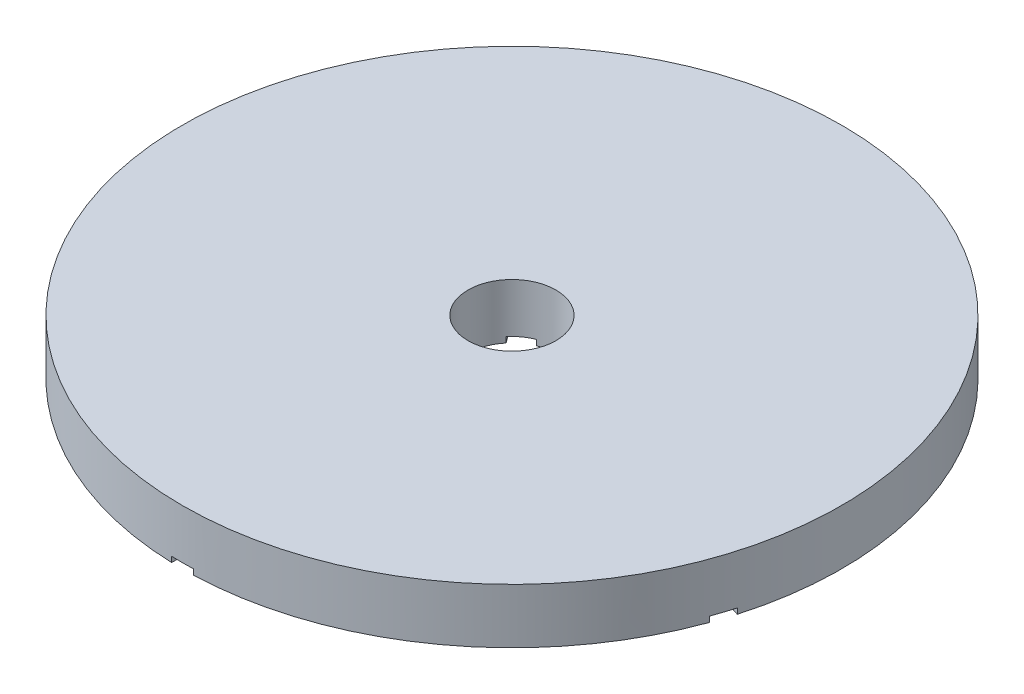
ISO-10303-21;
HEADER;
FILE_DESCRIPTION(('STEP AP214'),'2;1');
FILE_NAME('part.step','',(''),(''),'','','');
FILE_SCHEMA(('AUTOMOTIVE_DESIGN { 1 0 10303 214 1 1 1 1 }'));
ENDSEC;
DATA;
#1=APPLICATION_CONTEXT('core data for automotive mechanical design processes');
#2=APPLICATION_PROTOCOL_DEFINITION('international standard','automotive_design',2000,#1);
#3=PRODUCT_CONTEXT('',#1,'mechanical');
#4=PRODUCT('Part','Part','',(#3));
#5=PRODUCT_RELATED_PRODUCT_CATEGORY('part','',(#4));
#6=PRODUCT_DEFINITION_FORMATION('','',#4);
#7=PRODUCT_DEFINITION_CONTEXT('part definition',#1,'design');
#8=PRODUCT_DEFINITION('design','',#6,#7);
#9=PRODUCT_DEFINITION_SHAPE('','',#8);
#10=(LENGTH_UNIT() NAMED_UNIT(*) SI_UNIT(.MILLI.,.METRE.));
#11=(NAMED_UNIT(*) PLANE_ANGLE_UNIT() SI_UNIT($,.RADIAN.));
#12=(NAMED_UNIT(*) SI_UNIT($,.STERADIAN.) SOLID_ANGLE_UNIT());
#13=UNCERTAINTY_MEASURE_WITH_UNIT(LENGTH_MEASURE(1.E-05),#10,'distance_accuracy_value','');
#14=(GEOMETRIC_REPRESENTATION_CONTEXT(3) GLOBAL_UNCERTAINTY_ASSIGNED_CONTEXT((#13)) GLOBAL_UNIT_ASSIGNED_CONTEXT((#10,
#11,#12)) REPRESENTATION_CONTEXT('',''));
#15=CARTESIAN_POINT('',(0.,0.,0.));
#16=DIRECTION('',(0.,0.,1.));
#17=DIRECTION('',(1.,0.,0.));
#18=AXIS2_PLACEMENT_3D('',#15,#16,#17);
#19=CARTESIAN_POINT('',(0.,0.25,0.));
#20=DIRECTION('',(0.,1.,0.));
#21=DIRECTION('',(0.,0.,1.));
#22=AXIS2_PLACEMENT_3D('',#19,#20,#21);
#23=PLANE('',#22);
#24=CARTESIAN_POINT('',(0.,0.25,0.));
#25=DIRECTION('',(0.,1.,0.));
#26=DIRECTION('',(0.,0.,1.));
#27=AXIS2_PLACEMENT_3D('',#24,#25,#26);
#28=CIRCLE('',#27,2.);
#29=CARTESIAN_POINT('',(-1.68720452726912,0.25,1.07393709460219));
#30=VERTEX_POINT('',#29);
#31=CARTESIAN_POINT('',(-1.99622152164406,0.25,0.122880578307047));
#32=VERTEX_POINT('',#31);
#33=EDGE_CURVE('E421',#30,#32,#28,.F.);
#34=ORIENTED_EDGE('',*,*,#33,.F.);
#35=DIRECTION('',(-0.951056516295154,0.,0.309016994374945));
#36=VECTOR('',#35,1.);
#37=CARTESIAN_POINT('',(0.154508497187472,0.25,0.475528258147574));
#38=LINE('',#37,#36);
#39=CARTESIAN_POINT('',(-14.1034115735271,0.25,5.10820731643717));
#40=VERTEX_POINT('',#39);
#41=EDGE_CURVE('E339',#30,#40,#38,.T.);
#42=ORIENTED_EDGE('',*,*,#41,.T.);
#43=CARTESIAN_POINT('',(0.,0.25,0.));
#44=DIRECTION('',(0.,1.,0.));
#45=DIRECTION('',(0.,0.,1.));
#46=AXIS2_PLACEMENT_3D('',#43,#44,#45);
#47=CIRCLE('',#46,15.);
#48=CARTESIAN_POINT('',(-14.412428567902,0.25,4.15715080014206));
#49=VERTEX_POINT('',#48);
#50=EDGE_CURVE('E322',#49,#40,#47,.T.);
#51=ORIENTED_EDGE('',*,*,#50,.F.);
#52=DIRECTION('',(0.951056516295154,0.,-0.309016994374948));
#53=VECTOR('',#52,1.);
#54=CARTESIAN_POINT('',(-0.154508497187473,0.25,-0.475528258147574));
#55=LINE('',#54,#53);
#56=EDGE_CURVE('E337',#49,#32,#55,.T.);
#57=ORIENTED_EDGE('',*,*,#56,.T.);
#58=EDGE_LOOP('',(#34,#42,#51,#57));
#59=FACE_BOUND('',#58,.T.);
#60=ADVANCED_FACE('F93',(#59),#23,.F.);
#61=CARTESIAN_POINT('',(-1.542749743825,0.25,-1.27276204686025));
#62=VERTEX_POINT('',#61);
#63=CARTESIAN_POINT('',(-0.733732749450056,0.25,-1.86054729915272));
#64=VERTEX_POINT('',#63);
#65=EDGE_CURVE('E418',#62,#64,#28,.F.);
#66=ORIENTED_EDGE('',*,*,#65,.F.);
#67=DIRECTION('',(-0.587785252292469,0.,-0.809016994374951));
#68=VECTOR('',#67,1.);
#69=CARTESIAN_POINT('',(-0.404508497187473,0.25,0.293892626146233));
#70=LINE('',#69,#68);
#71=CARTESIAN_POINT('',(-9.2163877097683,0.25,-11.8346186074259));
#72=VERTEX_POINT('',#71);
#73=EDGE_CURVE('E345',#62,#72,#70,.T.);
#74=ORIENTED_EDGE('',*,*,#73,.T.);
#75=CARTESIAN_POINT('',(-8.40737071539336,0.25,-12.4224038597184));
#76=VERTEX_POINT('',#75);
#77=EDGE_CURVE('E324',#76,#72,#47,.T.);
#78=ORIENTED_EDGE('',*,*,#77,.F.);
#79=DIRECTION('',(0.587785252292469,0.,0.809016994374951));
#80=VECTOR('',#79,1.);
#81=CARTESIAN_POINT('',(0.404508497187473,0.25,-0.293892626146233));
#82=LINE('',#81,#80);
#83=EDGE_CURVE('E349',#76,#64,#82,.T.);
#84=ORIENTED_EDGE('',*,*,#83,.T.);
#85=EDGE_LOOP('',(#66,#74,#78,#84));
#86=FACE_BOUND('',#85,.T.);
#87=ADVANCED_FACE('F442',(#86),#23,.F.);
#88=CARTESIAN_POINT('',(0.733732749450082,0.25,-1.8605472991527));
#89=VERTEX_POINT('',#88);
#90=CARTESIAN_POINT('',(1.54274974382502,0.25,-1.27276204686023));
#91=VERTEX_POINT('',#90);
#92=EDGE_CURVE('E408',#89,#91,#28,.F.);
#93=ORIENTED_EDGE('',*,*,#92,.F.);
#94=DIRECTION('',(0.58778525229248,0.,-0.809016994374942));
#95=VECTOR('',#94,1.);
#96=CARTESIAN_POINT('',(-0.404508497187469,0.25,-0.293892626146238));
#97=LINE('',#96,#95);
#98=CARTESIAN_POINT('',(8.40737071539353,0.25,-12.4224038597183));
#99=VERTEX_POINT('',#98);
#100=EDGE_CURVE('E115',#89,#99,#97,.T.);
#101=ORIENTED_EDGE('',*,*,#100,.T.);
#102=CARTESIAN_POINT('',(9.21638770976847,0.25,-11.8346186074258));
#103=VERTEX_POINT('',#102);
#104=EDGE_CURVE('E101',#103,#99,#47,.T.);
#105=ORIENTED_EDGE('',*,*,#104,.F.);
#106=DIRECTION('',(-0.58778525229248,0.,0.809016994374942));
#107=VECTOR('',#106,1.);
#108=CARTESIAN_POINT('',(0.404508497187467,0.25,0.293892626146237));
#109=LINE('',#108,#107);
#110=EDGE_CURVE('E255',#103,#91,#109,.T.);
#111=ORIENTED_EDGE('',*,*,#110,.T.);
#112=EDGE_LOOP('',(#93,#101,#105,#111));
#113=FACE_BOUND('',#112,.T.);
#114=ADVANCED_FACE('F407',(#113),#23,.F.);
#115=CARTESIAN_POINT('',(1.99622152164406,0.25,0.12288057830707));
#116=VERTEX_POINT('',#115);
#117=CARTESIAN_POINT('',(1.6872045272691,0.25,1.07393709460221));
#118=VERTEX_POINT('',#117);
#119=EDGE_CURVE('E390',#116,#118,#28,.F.);
#120=ORIENTED_EDGE('',*,*,#119,.F.);
#121=DIRECTION('',(0.95105651629515,0.,0.309016994374958));
#122=VECTOR('',#121,1.);
#123=CARTESIAN_POINT('',(0.154508497187478,0.25,-0.475528258147572));
#124=LINE('',#123,#122);
#125=CARTESIAN_POINT('',(14.412428567902,0.25,4.15715080014222));
#126=VERTEX_POINT('',#125);
#127=EDGE_CURVE('E264',#116,#126,#124,.T.);
#128=ORIENTED_EDGE('',*,*,#127,.T.);
#129=CARTESIAN_POINT('',(14.103411573527,0.25,5.10820731643736));
#130=VERTEX_POINT('',#129);
#131=EDGE_CURVE('E317',#130,#126,#47,.T.);
#132=ORIENTED_EDGE('',*,*,#131,.F.);
#133=DIRECTION('',(-0.95105651629515,0.,-0.309016994374958));
#134=VECTOR('',#133,1.);
#135=CARTESIAN_POINT('',(14.1113392472398,0.25,5.11078317377194));
#136=LINE('',#135,#134);
#137=EDGE_CURVE('E266',#130,#118,#136,.T.);
#138=ORIENTED_EDGE('',*,*,#137,.T.);
#139=EDGE_LOOP('',(#120,#128,#132,#138));
#140=FACE_BOUND('',#139,.T.);
#141=ADVANCED_FACE('F389',(#140),#23,.F.);
#142=CARTESIAN_POINT('',(-0.404508497187469,0.25,-0.293892626146238));
#143=DIRECTION('',(-0.809016994374942,0.,-0.58778525229248));
#144=DIRECTION('',(-0.58778525229248,0.,0.809016994374942));
#145=AXIS2_PLACEMENT_3D('',#142,#143,#144);
#146=PLANE('',#145);
#147=DIRECTION('',(0.,-1.,0.));
#148=VECTOR('',#147,1.);
#149=CARTESIAN_POINT('',(0.733732749450082,2.5,-1.8605472991527));
#150=LINE('',#149,#148);
#151=CARTESIAN_POINT('',(0.733732749450082,0.,-1.8605472991527));
#152=VERTEX_POINT('',#151);
#153=EDGE_CURVE('E249',#152,#89,#150,.F.);
#154=ORIENTED_EDGE('',*,*,#153,.F.);
#155=DIRECTION('',(0.58778525229248,0.,-0.809016994374942));
#156=VECTOR('',#155,1.);
#157=CARTESIAN_POINT('',(-0.404508497187469,0.,-0.293892626146238));
#158=LINE('',#157,#156);
#159=CARTESIAN_POINT('',(8.40737071539353,0.,-12.4224038597183));
#160=VERTEX_POINT('',#159);
#161=EDGE_CURVE('E270',#152,#160,#158,.T.);
#162=ORIENTED_EDGE('',*,*,#161,.T.);
#163=DIRECTION('',(0.,-1.,0.));
#164=VECTOR('',#163,1.);
#165=CARTESIAN_POINT('',(8.40737071539353,2.5,-12.4224038597183));
#166=LINE('',#165,#164);
#167=EDGE_CURVE('E299',#99,#160,#166,.T.);
#168=ORIENTED_EDGE('',*,*,#167,.F.);
#169=ORIENTED_EDGE('',*,*,#100,.F.);
#170=EDGE_LOOP('',(#154,#162,#168,#169));
#171=FACE_BOUND('',#170,.T.);
#172=ADVANCED_FACE('F412',(#171),#146,.F.);
#173=CARTESIAN_POINT('',(0.404508497187473,0.25,-0.293892626146233));
#174=DIRECTION('',(0.809016994374951,0.,-0.587785252292469));
#175=DIRECTION('',(-0.587785252292469,0.,-0.809016994374951));
#176=AXIS2_PLACEMENT_3D('',#173,#174,#175);
#177=PLANE('',#176);
#178=DIRECTION('',(0.,-1.,0.));
#179=VECTOR('',#178,1.);
#180=CARTESIAN_POINT('',(-0.733732749450056,2.5,-1.86054729915271));
#181=LINE('',#180,#179);
#182=CARTESIAN_POINT('',(-0.733732749450055,0.,-1.86054729915272));
#183=VERTEX_POINT('',#182);
#184=EDGE_CURVE('E272',#64,#183,#181,.T.);
#185=ORIENTED_EDGE('',*,*,#184,.F.);
#186=ORIENTED_EDGE('',*,*,#83,.F.);
#187=DIRECTION('',(0.,-1.,0.));
#188=VECTOR('',#187,1.);
#189=CARTESIAN_POINT('',(-8.40737071539335,2.5,-12.4224038597184));
#190=LINE('',#189,#188);
#191=CARTESIAN_POINT('',(-8.40737071539336,0.,-12.4224038597184));
#192=VERTEX_POINT('',#191);
#193=EDGE_CURVE('E296',#192,#76,#190,.F.);
#194=ORIENTED_EDGE('',*,*,#193,.F.);
#195=DIRECTION('',(-0.587785252292469,0.,-0.809016994374951));
#196=VECTOR('',#195,1.);
#197=CARTESIAN_POINT('',(0.404508497187473,0.,-0.293892626146233));
#198=LINE('',#197,#196);
#199=EDGE_CURVE('E316',#183,#192,#198,.T.);
#200=ORIENTED_EDGE('',*,*,#199,.F.);
#201=EDGE_LOOP('',(#185,#186,#194,#200));
#202=FACE_BOUND('',#201,.T.);
#203=ADVANCED_FACE('F461',(#202),#177,.F.);
#204=CARTESIAN_POINT('',(-0.404508497187473,0.25,0.293892626146233));
#205=DIRECTION('',(-0.809016994374951,0.,0.587785252292469));
#206=DIRECTION('',(0.587785252292469,0.,0.809016994374951));
#207=AXIS2_PLACEMENT_3D('',#204,#205,#206);
#208=PLANE('',#207);
#209=DIRECTION('',(0.,-1.,0.));
#210=VECTOR('',#209,1.);
#211=CARTESIAN_POINT('',(-1.542749743825,2.5,-1.27276204686025));
#212=LINE('',#211,#210);
#213=CARTESIAN_POINT('',(-1.542749743825,0.,-1.27276204686025));
#214=VERTEX_POINT('',#213);
#215=EDGE_CURVE('E362',#214,#62,#212,.F.);
#216=ORIENTED_EDGE('',*,*,#215,.F.);
#217=DIRECTION('',(-0.587785252292469,0.,-0.809016994374951));
#218=VECTOR('',#217,1.);
#219=CARTESIAN_POINT('',(-0.404508497187473,0.,0.293892626146233));
#220=LINE('',#219,#218);
#221=CARTESIAN_POINT('',(-9.2163877097683,0.,-11.8346186074259));
#222=VERTEX_POINT('',#221);
#223=EDGE_CURVE('E260',#214,#222,#220,.T.);
#224=ORIENTED_EDGE('',*,*,#223,.T.);
#225=DIRECTION('',(0.,-1.,0.));
#226=VECTOR('',#225,1.);
#227=CARTESIAN_POINT('',(-9.2163877097683,2.5,-11.8346186074259));
#228=LINE('',#227,#226);
#229=EDGE_CURVE('E293',#72,#222,#228,.T.);
#230=ORIENTED_EDGE('',*,*,#229,.F.);
#231=ORIENTED_EDGE('',*,*,#73,.F.);
#232=EDGE_LOOP('',(#216,#224,#230,#231));
#233=FACE_BOUND('',#232,.T.);
#234=ADVANCED_FACE('F360',(#233),#208,.F.);
#235=CARTESIAN_POINT('',(-0.154508497187473,0.25,-0.475528258147574));
#236=DIRECTION('',(-0.309016994374947,0.,-0.951056516295154));
#237=DIRECTION('',(-0.951056516295154,0.,0.309016994374948));
#238=AXIS2_PLACEMENT_3D('',#235,#236,#237);
#239=PLANE('',#238);
#240=DIRECTION('',(0.,-1.,0.));
#241=VECTOR('',#240,1.);
#242=CARTESIAN_POINT('',(-1.99622152164406,2.5,0.122880578307048));
#243=LINE('',#242,#241);
#244=CARTESIAN_POINT('',(-1.99622152164406,0.,0.122880578307047));
#245=VERTEX_POINT('',#244);
#246=EDGE_CURVE('E344',#32,#245,#243,.T.);
#247=ORIENTED_EDGE('',*,*,#246,.F.);
#248=ORIENTED_EDGE('',*,*,#56,.F.);
#249=DIRECTION('',(0.,-1.,0.));
#250=VECTOR('',#249,1.);
#251=CARTESIAN_POINT('',(-14.412428567902,2.5,4.15715080014206));
#252=LINE('',#251,#250);
#253=CARTESIAN_POINT('',(-14.412428567902,0.,4.15715080014206));
#254=VERTEX_POINT('',#253);
#255=EDGE_CURVE('E290',#254,#49,#252,.F.);
#256=ORIENTED_EDGE('',*,*,#255,.F.);
#257=DIRECTION('',(-0.951056516295154,0.,0.309016994374948));
#258=VECTOR('',#257,1.);
#259=CARTESIAN_POINT('',(-0.154508497187473,0.,-0.475528258147574));
#260=LINE('',#259,#258);
#261=EDGE_CURVE('E314',#245,#254,#260,.T.);
#262=ORIENTED_EDGE('',*,*,#261,.F.);
#263=EDGE_LOOP('',(#247,#248,#256,#262));
#264=FACE_BOUND('',#263,.T.);
#265=ADVANCED_FACE('F342',(#264),#239,.F.);
#266=CARTESIAN_POINT('',(0.154508497187472,0.25,0.475528258147574));
#267=DIRECTION('',(0.309016994374945,0.,0.951056516295154));
#268=DIRECTION('',(0.951056516295154,0.,-0.309016994374945));
#269=AXIS2_PLACEMENT_3D('',#266,#267,#268);
#270=PLANE('',#269);
#271=DIRECTION('',(0.,-1.,0.));
#272=VECTOR('',#271,1.);
#273=CARTESIAN_POINT('',(-1.68720452726912,2.5,1.07393709460219));
#274=LINE('',#273,#272);
#275=CARTESIAN_POINT('',(-1.68720452726912,0.,1.07393709460219));
#276=VERTEX_POINT('',#275);
#277=EDGE_CURVE('E422',#276,#30,#274,.F.);
#278=ORIENTED_EDGE('',*,*,#277,.F.);
#279=DIRECTION('',(-0.951056516295154,0.,0.309016994374945));
#280=VECTOR('',#279,1.);
#281=CARTESIAN_POINT('',(0.154508497187472,0.,0.475528258147574));
#282=LINE('',#281,#280);
#283=CARTESIAN_POINT('',(-14.1034115735271,0.,5.10820731643717));
#284=VERTEX_POINT('',#283);
#285=EDGE_CURVE('E256',#276,#284,#282,.T.);
#286=ORIENTED_EDGE('',*,*,#285,.T.);
#287=DIRECTION('',(0.,-1.,0.));
#288=VECTOR('',#287,1.);
#289=CARTESIAN_POINT('',(-14.1034115735271,2.5,5.10820731643717));
#290=LINE('',#289,#288);
#291=EDGE_CURVE('E287',#40,#284,#290,.T.);
#292=ORIENTED_EDGE('',*,*,#291,.F.);
#293=ORIENTED_EDGE('',*,*,#41,.F.);
#294=EDGE_LOOP('',(#278,#286,#292,#293));
#295=FACE_BOUND('',#294,.T.);
#296=ADVANCED_FACE('F575',(#295),#270,.F.);
#297=CARTESIAN_POINT('',(-0.499999999999997,0.25,0.));
#298=DIRECTION('',(-1.,0.,0.));
#299=DIRECTION('',(0.,0.,1.));
#300=AXIS2_PLACEMENT_3D('',#297,#298,#299);
#301=PLANE('',#300);
#302=DIRECTION('',(0.,-1.,0.));
#303=VECTOR('',#302,1.);
#304=CARTESIAN_POINT('',(-0.499999999999997,2.5,1.93649167310371));
#305=LINE('',#304,#303);
#306=CARTESIAN_POINT('',(-0.499999999999997,0.25,1.93649167310371));
#307=VERTEX_POINT('',#306);
#308=CARTESIAN_POINT('',(-0.499999999999997,0.,1.93649167310371));
#309=VERTEX_POINT('',#308);
#310=EDGE_CURVE('E380',#307,#309,#305,.T.);
#311=ORIENTED_EDGE('',*,*,#310,.F.);
#312=DIRECTION('',(0.,0.,-1.));
#313=VECTOR('',#312,1.);
#314=CARTESIAN_POINT('',(-0.499999999999997,0.25,0.));
#315=LINE('',#314,#313);
#316=CARTESIAN_POINT('',(-0.499999999999993,0.25,14.9916643505649));
#317=VERTEX_POINT('',#316);
#318=EDGE_CURVE('E347',#317,#307,#315,.T.);
#319=ORIENTED_EDGE('',*,*,#318,.F.);
#320=DIRECTION('',(0.,-1.,0.));
#321=VECTOR('',#320,1.);
#322=CARTESIAN_POINT('',(-0.499999999999993,2.5,14.9916643505649));
#323=LINE('',#322,#321);
#324=CARTESIAN_POINT('',(-0.499999999999993,0.,14.9916643505649));
#325=VERTEX_POINT('',#324);
#326=EDGE_CURVE('E284',#325,#317,#323,.F.);
#327=ORIENTED_EDGE('',*,*,#326,.F.);
#328=DIRECTION('',(0.,0.,1.));
#329=VECTOR('',#328,1.);
#330=CARTESIAN_POINT('',(-0.499999999999997,0.,0.));
#331=LINE('',#330,#329);
#332=EDGE_CURVE('E312',#309,#325,#331,.T.);
#333=ORIENTED_EDGE('',*,*,#332,.F.);
#334=EDGE_LOOP('',(#311,#319,#327,#333));
#335=FACE_BOUND('',#334,.T.);
#336=ADVANCED_FACE('F379',(#335),#301,.F.);
#337=CARTESIAN_POINT('',(0.499999999999997,0.25,0.));
#338=DIRECTION('',(1.,0.,0.));
#339=DIRECTION('',(0.,0.,-1.));
#340=AXIS2_PLACEMENT_3D('',#337,#338,#339);
#341=PLANE('',#340);
#342=DIRECTION('',(0.,-1.,0.));
#343=VECTOR('',#342,1.);
#344=CARTESIAN_POINT('',(0.499999999999997,2.5,1.93649167310371));
#345=LINE('',#344,#343);
#346=CARTESIAN_POINT('',(0.499999999999997,0.,1.93649167310371));
#347=VERTEX_POINT('',#346);
#348=CARTESIAN_POINT('',(0.499999999999997,0.25,1.93649167310371));
#349=VERTEX_POINT('',#348);
#350=EDGE_CURVE('E231',#347,#349,#345,.F.);
#351=ORIENTED_EDGE('',*,*,#350,.F.);
#352=DIRECTION('',(0.,0.,1.));
#353=VECTOR('',#352,1.);
#354=CARTESIAN_POINT('',(0.499999999999997,0.,0.));
#355=LINE('',#354,#353);
#356=CARTESIAN_POINT('',(0.499999999999999,0.,14.9916643505649));
#357=VERTEX_POINT('',#356);
#358=EDGE_CURVE('E245',#347,#357,#355,.T.);
#359=ORIENTED_EDGE('',*,*,#358,.T.);
#360=DIRECTION('',(0.,-1.,0.));
#361=VECTOR('',#360,1.);
#362=CARTESIAN_POINT('',(0.499999999999999,2.5,14.9916643505649));
#363=LINE('',#362,#361);
#364=CARTESIAN_POINT('',(0.499999999999999,0.25,14.9916643505649));
#365=VERTEX_POINT('',#364);
#366=EDGE_CURVE('E282',#365,#357,#363,.T.);
#367=ORIENTED_EDGE('',*,*,#366,.F.);
#368=DIRECTION('',(0.,0.,1.));
#369=VECTOR('',#368,1.);
#370=CARTESIAN_POINT('',(0.499999999999997,0.25,0.));
#371=LINE('',#370,#369);
#372=EDGE_CURVE('E247',#349,#365,#371,.T.);
#373=ORIENTED_EDGE('',*,*,#372,.F.);
#374=EDGE_LOOP('',(#351,#359,#367,#373));
#375=FACE_BOUND('',#374,.T.);
#376=ADVANCED_FACE('F243',(#375),#341,.F.);
#377=CARTESIAN_POINT('',(0.404508497187467,0.25,0.293892626146237));
#378=DIRECTION('',(0.809016994374942,0.,0.58778525229248));
#379=DIRECTION('',(0.58778525229248,0.,-0.809016994374942));
#380=AXIS2_PLACEMENT_3D('',#377,#378,#379);
#381=PLANE('',#380);
#382=DIRECTION('',(0.,-1.,0.));
#383=VECTOR('',#382,1.);
#384=CARTESIAN_POINT('',(1.54274974382502,2.5,-1.27276204686023));
#385=LINE('',#384,#383);
#386=CARTESIAN_POINT('',(1.54274974382502,0.,-1.27276204686023));
#387=VERTEX_POINT('',#386);
#388=EDGE_CURVE('E406',#91,#387,#385,.T.);
#389=ORIENTED_EDGE('',*,*,#388,.F.);
#390=ORIENTED_EDGE('',*,*,#110,.F.);
#391=DIRECTION('',(0.,-1.,0.));
#392=VECTOR('',#391,1.);
#393=CARTESIAN_POINT('',(9.21638770976847,2.5,-11.8346186074258));
#394=LINE('',#393,#392);
#395=CARTESIAN_POINT('',(9.21638770976847,0.,-11.8346186074258));
#396=VERTEX_POINT('',#395);
#397=EDGE_CURVE('E279',#396,#103,#394,.F.);
#398=ORIENTED_EDGE('',*,*,#397,.F.);
#399=DIRECTION('',(0.58778525229248,0.,-0.809016994374942));
#400=VECTOR('',#399,1.);
#401=CARTESIAN_POINT('',(0.404508497187467,0.,0.293892626146237));
#402=LINE('',#401,#400);
#403=EDGE_CURVE('E306',#387,#396,#402,.T.);
#404=ORIENTED_EDGE('',*,*,#403,.F.);
#405=EDGE_LOOP('',(#389,#390,#398,#404));
#406=FACE_BOUND('',#405,.T.);
#407=ADVANCED_FACE('F405',(#406),#381,.F.);
#408=CARTESIAN_POINT('',(14.1113392472398,0.25,5.11078317377194));
#409=DIRECTION('',(-0.309016994374958,0.,0.95105651629515));
#410=DIRECTION('',(0.95105651629515,0.,0.309016994374958));
#411=AXIS2_PLACEMENT_3D('',#408,#409,#410);
#412=PLANE('',#411);
#413=DIRECTION('',(0.,-1.,0.));
#414=VECTOR('',#413,1.);
#415=CARTESIAN_POINT('',(1.6872045272691,2.5,1.07393709460221));
#416=LINE('',#415,#414);
#417=CARTESIAN_POINT('',(1.6872045272691,0.,1.07393709460221));
#418=VERTEX_POINT('',#417);
#419=EDGE_CURVE('E234',#118,#418,#416,.T.);
#420=ORIENTED_EDGE('',*,*,#419,.F.);
#421=ORIENTED_EDGE('',*,*,#137,.F.);
#422=DIRECTION('',(0.,-1.,0.));
#423=VECTOR('',#422,1.);
#424=CARTESIAN_POINT('',(14.103411573527,2.5,5.10820731643736));
#425=LINE('',#424,#423);
#426=CARTESIAN_POINT('',(14.103411573527,0.,5.10820731643736));
#427=VERTEX_POINT('',#426);
#428=EDGE_CURVE('E276',#427,#130,#425,.F.);
#429=ORIENTED_EDGE('',*,*,#428,.F.);
#430=DIRECTION('',(0.95105651629515,0.,0.309016994374958));
#431=VECTOR('',#430,1.);
#432=CARTESIAN_POINT('',(-0.154508497187478,0.,0.475528258147572));
#433=LINE('',#432,#431);
#434=EDGE_CURVE('E310',#418,#427,#433,.T.);
#435=ORIENTED_EDGE('',*,*,#434,.F.);
#436=EDGE_LOOP('',(#420,#421,#429,#435));
#437=FACE_BOUND('',#436,.T.);
#438=ADVANCED_FACE('F386',(#437),#412,.F.);
#439=CARTESIAN_POINT('',(0.154508497187478,0.25,-0.475528258147572));
#440=DIRECTION('',(0.309016994374958,0.,-0.95105651629515));
#441=DIRECTION('',(-0.95105651629515,0.,-0.309016994374958));
#442=AXIS2_PLACEMENT_3D('',#439,#440,#441);
#443=PLANE('',#442);
#444=DIRECTION('',(0.,-1.,0.));
#445=VECTOR('',#444,1.);
#446=CARTESIAN_POINT('',(1.99622152164406,2.5,0.12288057830707));
#447=LINE('',#446,#445);
#448=CARTESIAN_POINT('',(1.99622152164406,0.,0.12288057830707));
#449=VERTEX_POINT('',#448);
#450=EDGE_CURVE('E12',#449,#116,#447,.F.);
#451=ORIENTED_EDGE('',*,*,#450,.F.);
#452=DIRECTION('',(0.95105651629515,0.,0.309016994374958));
#453=VECTOR('',#452,1.);
#454=CARTESIAN_POINT('',(0.154508497187478,0.,-0.475528258147572));
#455=LINE('',#454,#453);
#456=CARTESIAN_POINT('',(14.412428567902,0.,4.15715080014222));
#457=VERTEX_POINT('',#456);
#458=EDGE_CURVE('E267',#449,#457,#455,.T.);
#459=ORIENTED_EDGE('',*,*,#458,.T.);
#460=DIRECTION('',(0.,-1.,0.));
#461=VECTOR('',#460,1.);
#462=CARTESIAN_POINT('',(14.412428567902,2.5,4.15715080014222));
#463=LINE('',#462,#461);
#464=EDGE_CURVE('E273',#126,#457,#463,.T.);
#465=ORIENTED_EDGE('',*,*,#464,.F.);
#466=ORIENTED_EDGE('',*,*,#127,.F.);
#467=EDGE_LOOP('',(#451,#459,#465,#466));
#468=FACE_BOUND('',#467,.T.);
#469=ADVANCED_FACE('F394',(#468),#443,.F.);
#470=CARTESIAN_POINT('',(0.,0.,0.));
#471=DIRECTION('',(0.,1.,0.));
#472=DIRECTION('',(0.,0.,1.));
#473=AXIS2_PLACEMENT_3D('',#470,#471,#472);
#474=PLANE('',#473);
#475=CARTESIAN_POINT('',(0.,0.,0.));
#476=DIRECTION('',(0.,1.,0.));
#477=DIRECTION('',(0.,0.,1.));
#478=AXIS2_PLACEMENT_3D('',#475,#476,#477);
#479=CIRCLE('',#478,2.);
#480=EDGE_CURVE('E693',#152,#183,#479,.T.);
#481=ORIENTED_EDGE('',*,*,#480,.T.);
#482=ORIENTED_EDGE('',*,*,#199,.T.);
#483=CARTESIAN_POINT('',(0.,0.,0.));
#484=DIRECTION('',(0.,1.,0.));
#485=DIRECTION('',(0.,0.,1.));
#486=AXIS2_PLACEMENT_3D('',#483,#484,#485);
#487=CIRCLE('',#486,15.);
#488=EDGE_CURVE('E368',#160,#192,#487,.T.);
#489=ORIENTED_EDGE('',*,*,#488,.F.);
#490=ORIENTED_EDGE('',*,*,#161,.F.);
#491=EDGE_LOOP('',(#481,#482,#489,#490));
#492=FACE_BOUND('',#491,.T.);
#493=ADVANCED_FACE('F455',(#492),#474,.F.);
#494=EDGE_CURVE('E692',#214,#245,#479,.T.);
#495=ORIENTED_EDGE('',*,*,#494,.T.);
#496=ORIENTED_EDGE('',*,*,#261,.T.);
#497=EDGE_CURVE('E366',#222,#254,#487,.T.);
#498=ORIENTED_EDGE('',*,*,#497,.F.);
#499=ORIENTED_EDGE('',*,*,#223,.F.);
#500=EDGE_LOOP('',(#495,#496,#498,#499));
#501=FACE_BOUND('',#500,.T.);
#502=ADVANCED_FACE('F367',(#501),#474,.F.);
#503=EDGE_CURVE('E240',#276,#309,#479,.T.);
#504=ORIENTED_EDGE('',*,*,#503,.T.);
#505=ORIENTED_EDGE('',*,*,#332,.T.);
#506=EDGE_CURVE('E302',#284,#325,#487,.T.);
#507=ORIENTED_EDGE('',*,*,#506,.F.);
#508=ORIENTED_EDGE('',*,*,#285,.F.);
#509=EDGE_LOOP('',(#504,#505,#507,#508));
#510=FACE_BOUND('',#509,.T.);
#511=ADVANCED_FACE('F374',(#510),#474,.F.);
#512=EDGE_CURVE('E228',#347,#418,#479,.T.);
#513=ORIENTED_EDGE('',*,*,#512,.T.);
#514=ORIENTED_EDGE('',*,*,#434,.T.);
#515=EDGE_CURVE('E254',#357,#427,#487,.T.);
#516=ORIENTED_EDGE('',*,*,#515,.F.);
#517=ORIENTED_EDGE('',*,*,#358,.F.);
#518=EDGE_LOOP('',(#513,#514,#516,#517));
#519=FACE_BOUND('',#518,.T.);
#520=ADVANCED_FACE('F252',(#519),#474,.F.);
#521=CARTESIAN_POINT('',(0.,2.5,0.));
#522=DIRECTION('',(0.,-1.,0.));
#523=DIRECTION('',(0.,0.,-1.));
#524=AXIS2_PLACEMENT_3D('',#521,#522,#523);
#525=CYLINDRICAL_SURFACE('',#524,15.);
#526=ORIENTED_EDGE('',*,*,#104,.T.);
#527=ORIENTED_EDGE('',*,*,#167,.T.);
#528=ORIENTED_EDGE('',*,*,#488,.T.);
#529=ORIENTED_EDGE('',*,*,#193,.T.);
#530=ORIENTED_EDGE('',*,*,#77,.T.);
#531=ORIENTED_EDGE('',*,*,#229,.T.);
#532=ORIENTED_EDGE('',*,*,#497,.T.);
#533=ORIENTED_EDGE('',*,*,#255,.T.);
#534=ORIENTED_EDGE('',*,*,#50,.T.);
#535=ORIENTED_EDGE('',*,*,#291,.T.);
#536=ORIENTED_EDGE('',*,*,#506,.T.);
#537=ORIENTED_EDGE('',*,*,#326,.T.);
#538=EDGE_CURVE('E319',#317,#365,#47,.T.);
#539=ORIENTED_EDGE('',*,*,#538,.T.);
#540=ORIENTED_EDGE('',*,*,#366,.T.);
#541=ORIENTED_EDGE('',*,*,#515,.T.);
#542=ORIENTED_EDGE('',*,*,#428,.T.);
#543=ORIENTED_EDGE('',*,*,#131,.T.);
#544=ORIENTED_EDGE('',*,*,#464,.T.);
#545=EDGE_CURVE('E308',#457,#396,#487,.T.);
#546=ORIENTED_EDGE('',*,*,#545,.T.);
#547=ORIENTED_EDGE('',*,*,#397,.T.);
#548=EDGE_LOOP('',(#526,#527,#528,#529,#530,#531,#532,#533,#534,#535,#536,#537,#539,#540,#541,
#542,#543,#544,#546,#547));
#549=FACE_BOUND('',#548,.T.);
#550=CARTESIAN_POINT('',(0.,2.5,0.));
#551=DIRECTION('',(0.,1.,0.));
#552=DIRECTION('',(0.,0.,1.));
#553=AXIS2_PLACEMENT_3D('',#550,#551,#552);
#554=CIRCLE('',#553,15.);
#555=CARTESIAN_POINT('',(0.,2.5,15.));
#556=VERTEX_POINT('',#555);
#557=EDGE_CURVE('E303',#556,#556,#554,.T.);
#558=ORIENTED_EDGE('',*,*,#557,.F.);
#559=EDGE_LOOP('',(#558));
#560=FACE_BOUND('',#559,.T.);
#561=ADVANCED_FACE('F95',(#549,#560),#525,.T.);
#562=CARTESIAN_POINT('',(0.,2.5,0.));
#563=DIRECTION('',(0.,1.,0.));
#564=DIRECTION('',(0.,0.,1.));
#565=AXIS2_PLACEMENT_3D('',#562,#563,#564);
#566=PLANE('',#565);
#567=CARTESIAN_POINT('',(0.,2.5,0.));
#568=DIRECTION('',(0.,1.,0.));
#569=DIRECTION('',(0.,0.,1.));
#570=AXIS2_PLACEMENT_3D('',#567,#568,#569);
#571=CIRCLE('',#570,2.);
#572=CARTESIAN_POINT('',(0.,2.5,2.));
#573=VERTEX_POINT('',#572);
#574=EDGE_CURVE('E238',#573,#573,#571,.T.);
#575=ORIENTED_EDGE('',*,*,#574,.F.);
#576=EDGE_LOOP('',(#575));
#577=FACE_BOUND('',#576,.T.);
#578=ORIENTED_EDGE('',*,*,#557,.T.);
#579=EDGE_LOOP('',(#578));
#580=FACE_BOUND('',#579,.T.);
#581=ADVANCED_FACE('F432',(#577,#580),#566,.T.);
#582=EDGE_CURVE('E107',#449,#387,#479,.T.);
#583=ORIENTED_EDGE('',*,*,#582,.T.);
#584=ORIENTED_EDGE('',*,*,#403,.T.);
#585=ORIENTED_EDGE('',*,*,#545,.F.);
#586=ORIENTED_EDGE('',*,*,#458,.F.);
#587=EDGE_LOOP('',(#583,#584,#585,#586));
#588=FACE_BOUND('',#587,.T.);
#589=ADVANCED_FACE('F399',(#588),#474,.F.);
#590=EDGE_CURVE('E248',#349,#307,#28,.F.);
#591=ORIENTED_EDGE('',*,*,#590,.F.);
#592=ORIENTED_EDGE('',*,*,#372,.T.);
#593=ORIENTED_EDGE('',*,*,#538,.F.);
#594=ORIENTED_EDGE('',*,*,#318,.T.);
#595=EDGE_LOOP('',(#591,#592,#593,#594));
#596=FACE_BOUND('',#595,.T.);
#597=ADVANCED_FACE('F382',(#596),#23,.F.);
#598=CARTESIAN_POINT('',(0.,2.5,0.));
#599=DIRECTION('',(0.,-1.,0.));
#600=DIRECTION('',(0.,0.,-1.));
#601=AXIS2_PLACEMENT_3D('',#598,#599,#600);
#602=CYLINDRICAL_SURFACE('',#601,2.);
#603=ORIENTED_EDGE('',*,*,#574,.T.);
#604=EDGE_LOOP('',(#603));
#605=FACE_BOUND('',#604,.T.);
#606=ORIENTED_EDGE('',*,*,#184,.T.);
#607=ORIENTED_EDGE('',*,*,#480,.F.);
#608=ORIENTED_EDGE('',*,*,#153,.T.);
#609=ORIENTED_EDGE('',*,*,#92,.T.);
#610=ORIENTED_EDGE('',*,*,#388,.T.);
#611=ORIENTED_EDGE('',*,*,#582,.F.);
#612=ORIENTED_EDGE('',*,*,#450,.T.);
#613=ORIENTED_EDGE('',*,*,#119,.T.);
#614=ORIENTED_EDGE('',*,*,#419,.T.);
#615=ORIENTED_EDGE('',*,*,#512,.F.);
#616=ORIENTED_EDGE('',*,*,#350,.T.);
#617=ORIENTED_EDGE('',*,*,#590,.T.);
#618=ORIENTED_EDGE('',*,*,#310,.T.);
#619=ORIENTED_EDGE('',*,*,#503,.F.);
#620=ORIENTED_EDGE('',*,*,#277,.T.);
#621=ORIENTED_EDGE('',*,*,#33,.T.);
#622=ORIENTED_EDGE('',*,*,#246,.T.);
#623=ORIENTED_EDGE('',*,*,#494,.F.);
#624=ORIENTED_EDGE('',*,*,#215,.T.);
#625=ORIENTED_EDGE('',*,*,#65,.T.);
#626=EDGE_LOOP('',(#606,#607,#608,#609,#610,#611,#612,#613,#614,#615,#616,#617,#618,#619,#620,
#621,#622,#623,#624,#625));
#627=FACE_BOUND('',#626,.T.);
#628=ADVANCED_FACE('F230',(#605,#627),#602,.F.);
#629=CLOSED_SHELL('',(#60,#87,#114,#141,#172,#203,#234,#265,#296,#336,#376,#407,#438,#469,#493,
#502,#511,#520,#561,#581,#589,#597,#628));
#630=MANIFOLD_SOLID_BREP('B2',#629);
#631=ADVANCED_BREP_SHAPE_REPRESENTATION('',(#18,#630),#14);
#632=SHAPE_DEFINITION_REPRESENTATION(#9,#631);
ENDSEC;
END-ISO-10303-21;
